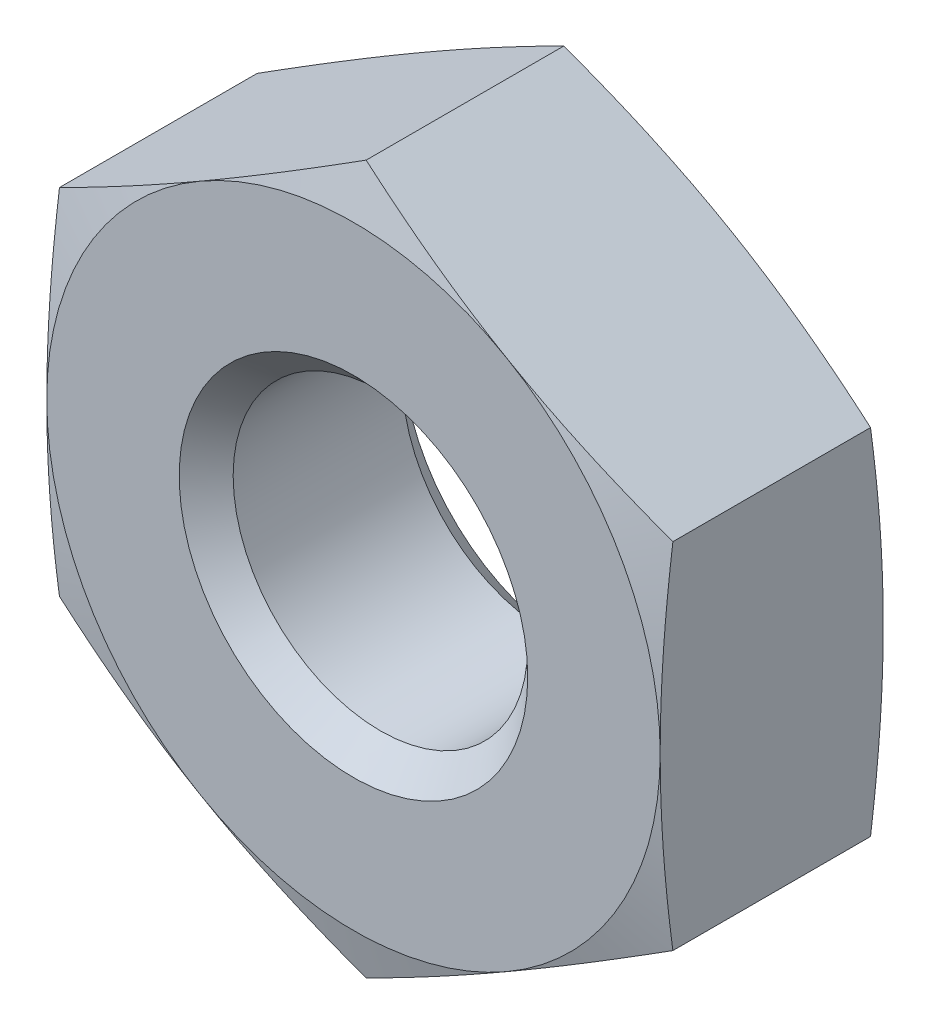
ISO-10303-21;
HEADER;
FILE_DESCRIPTION(('STEP AP214'),'2;1');
FILE_NAME('part.step','',(''),(''),'','','');
FILE_SCHEMA(('AUTOMOTIVE_DESIGN { 1 0 10303 214 1 1 1 1 }'));
ENDSEC;
DATA;
#1=APPLICATION_CONTEXT('core data for automotive mechanical design processes');
#2=APPLICATION_PROTOCOL_DEFINITION('international standard','automotive_design',2000,#1);
#3=PRODUCT_CONTEXT('',#1,'mechanical');
#4=PRODUCT('Part','Part','',(#3));
#5=PRODUCT_RELATED_PRODUCT_CATEGORY('part','',(#4));
#6=PRODUCT_DEFINITION_FORMATION('','',#4);
#7=PRODUCT_DEFINITION_CONTEXT('part definition',#1,'design');
#8=PRODUCT_DEFINITION('design','',#6,#7);
#9=PRODUCT_DEFINITION_SHAPE('','',#8);
#10=(LENGTH_UNIT() NAMED_UNIT(*) SI_UNIT(.MILLI.,.METRE.));
#11=(NAMED_UNIT(*) PLANE_ANGLE_UNIT() SI_UNIT($,.RADIAN.));
#12=(NAMED_UNIT(*) SI_UNIT($,.STERADIAN.) SOLID_ANGLE_UNIT());
#13=UNCERTAINTY_MEASURE_WITH_UNIT(LENGTH_MEASURE(1.E-05),#10,'distance_accuracy_value','');
#14=(GEOMETRIC_REPRESENTATION_CONTEXT(3) GLOBAL_UNCERTAINTY_ASSIGNED_CONTEXT((#13)) GLOBAL_UNIT_ASSIGNED_CONTEXT((#10,
#11,#12)) REPRESENTATION_CONTEXT('',''));
#15=CARTESIAN_POINT('',(0.,0.,0.));
#16=DIRECTION('',(0.,0.,1.));
#17=DIRECTION('',(1.,0.,0.));
#18=AXIS2_PLACEMENT_3D('',#15,#16,#17);
#19=CARTESIAN_POINT('',(0.,0.,0.));
#20=DIRECTION('',(0.,0.,-1.));
#21=DIRECTION('',(-1.,0.,0.));
#22=AXIS2_PLACEMENT_3D('',#19,#20,#21);
#23=PLANE('',#22);
#24=CARTESIAN_POINT('',(0.,0.,0.));
#25=DIRECTION('',(0.,0.,1.));
#26=DIRECTION('',(1.,0.,0.));
#27=AXIS2_PLACEMENT_3D('',#24,#25,#26);
#28=CIRCLE('',#27,5.588);
#29=CARTESIAN_POINT('',(5.588,0.,0.));
#30=VERTEX_POINT('',#29);
#31=CARTESIAN_POINT('',(2.79400000000005,4.83934995634742,0.));
#32=VERTEX_POINT('',#31);
#33=EDGE_CURVE('E11',#30,#32,#28,.T.);
#34=ORIENTED_EDGE('',*,*,#33,.T.);
#35=CARTESIAN_POINT('',(-2.79400000000005,4.83934995634742,0.));
#36=VERTEX_POINT('',#35);
#37=EDGE_CURVE('E44',#32,#36,#28,.T.);
#38=ORIENTED_EDGE('',*,*,#37,.T.);
#39=CARTESIAN_POINT('',(-5.588,0.,0.));
#40=VERTEX_POINT('',#39);
#41=EDGE_CURVE('E329',#36,#40,#28,.T.);
#42=ORIENTED_EDGE('',*,*,#41,.T.);
#43=CARTESIAN_POINT('',(-2.79400000000005,-4.83934995634742,0.));
#44=VERTEX_POINT('',#43);
#45=EDGE_CURVE('E322',#40,#44,#28,.T.);
#46=ORIENTED_EDGE('',*,*,#45,.T.);
#47=CARTESIAN_POINT('',(2.79400000000005,-4.83934995634742,0.));
#48=VERTEX_POINT('',#47);
#49=EDGE_CURVE('E325',#44,#48,#28,.T.);
#50=ORIENTED_EDGE('',*,*,#49,.T.);
#51=EDGE_CURVE('E45',#48,#30,#28,.T.);
#52=ORIENTED_EDGE('',*,*,#51,.T.);
#53=EDGE_LOOP('',(#34,#38,#42,#46,#50,#52));
#54=FACE_BOUND('',#53,.T.);
#55=CARTESIAN_POINT('',(0.,0.,0.));
#56=DIRECTION('',(0.,0.,1.));
#57=DIRECTION('',(1.,0.,0.));
#58=AXIS2_PLACEMENT_3D('',#55,#56,#57);
#59=CIRCLE('',#58,3.175);
#60=CARTESIAN_POINT('',(3.175,0.,0.));
#61=VERTEX_POINT('',#60);
#62=EDGE_CURVE('E186',#61,#61,#59,.T.);
#63=ORIENTED_EDGE('',*,*,#62,.F.);
#64=EDGE_LOOP('',(#63));
#65=FACE_BOUND('',#64,.T.);
#66=ADVANCED_FACE('F37',(#54,#65),#23,.F.);
#67=CARTESIAN_POINT('',(0.,5.588,-4.064));
#68=DIRECTION('',(0.,0.,1.));
#69=DIRECTION('',(1.,0.,0.));
#70=AXIS2_PLACEMENT_3D('',#67,#68,#69);
#71=PLANE('',#70);
#72=CARTESIAN_POINT('',(0.,0.,-4.064));
#73=DIRECTION('',(0.,0.,1.));
#74=DIRECTION('',(1.,0.,0.));
#75=AXIS2_PLACEMENT_3D('',#72,#73,#74);
#76=CIRCLE('',#75,5.588);
#77=CARTESIAN_POINT('',(5.588,0.,-4.064));
#78=VERTEX_POINT('',#77);
#79=CARTESIAN_POINT('',(2.79400000000005,4.83934995634742,-4.064));
#80=VERTEX_POINT('',#79);
#81=EDGE_CURVE('E360',#78,#80,#76,.T.);
#82=ORIENTED_EDGE('',*,*,#81,.F.);
#83=CARTESIAN_POINT('',(2.79400000000005,-4.83934995634742,-4.064));
#84=VERTEX_POINT('',#83);
#85=EDGE_CURVE('E363',#84,#78,#76,.T.);
#86=ORIENTED_EDGE('',*,*,#85,.F.);
#87=CARTESIAN_POINT('',(-2.79400000000005,-4.83934995634742,-4.064));
#88=VERTEX_POINT('',#87);
#89=EDGE_CURVE('E364',#88,#84,#76,.T.);
#90=ORIENTED_EDGE('',*,*,#89,.F.);
#91=CARTESIAN_POINT('',(-5.588,0.,-4.064));
#92=VERTEX_POINT('',#91);
#93=EDGE_CURVE('E144',#92,#88,#76,.T.);
#94=ORIENTED_EDGE('',*,*,#93,.F.);
#95=CARTESIAN_POINT('',(-2.79400000000005,4.83934995634742,-4.064));
#96=VERTEX_POINT('',#95);
#97=EDGE_CURVE('E361',#96,#92,#76,.T.);
#98=ORIENTED_EDGE('',*,*,#97,.F.);
#99=EDGE_CURVE('E357',#80,#96,#76,.T.);
#100=ORIENTED_EDGE('',*,*,#99,.F.);
#101=EDGE_LOOP('',(#82,#86,#90,#94,#98,#100));
#102=FACE_BOUND('',#101,.T.);
#103=CARTESIAN_POINT('',(0.,0.,-4.064));
#104=DIRECTION('',(0.,0.,1.));
#105=DIRECTION('',(1.,0.,0.));
#106=AXIS2_PLACEMENT_3D('',#103,#104,#105);
#107=CIRCLE('',#106,3.175);
#108=CARTESIAN_POINT('',(3.175,0.,-4.064));
#109=VERTEX_POINT('',#108);
#110=EDGE_CURVE('E206',#109,#109,#107,.T.);
#111=ORIENTED_EDGE('',*,*,#110,.T.);
#112=EDGE_LOOP('',(#111));
#113=FACE_BOUND('',#112,.T.);
#114=ADVANCED_FACE('F210',(#102,#113),#71,.F.);
#115=CARTESIAN_POINT('',(0.,0.,-0.29946001746102));
#116=DIRECTION('',(0.,0.,-1.));
#117=DIRECTION('',(-1.,0.,0.));
#118=AXIS2_PLACEMENT_3D('',#115,#116,#117);
#119=CONICAL_SURFACE('',#118,6.7056,1.30899693899575);
#120=CARTESIAN_POINT('',(-5.5882,3.22611783417776,-0.231664070559589));
#121=CARTESIAN_POINT('',(-5.35612782990446,3.36010476405385,-0.195746870929783));
#122=CARTESIAN_POINT('',(-5.12363487986488,3.49433463134389,-0.163139951670658));
#123=CARTESIAN_POINT('',(-4.65782789403413,3.76326842000369,-0.105852616921359));
#124=CARTESIAN_POINT('',(-4.42451356350618,3.8979725115398,-0.0811754211835394));
#125=CARTESIAN_POINT('',(-3.95847843653514,4.16703801754836,-0.0411882021790151));
#126=CARTESIAN_POINT('',(-3.72576079157954,4.30139761250865,-0.0258304913572314));
#127=CARTESIAN_POINT('',(-3.26002872031104,4.57028814922577,-0.0052373695311401));
#128=CARTESIAN_POINT('',(-3.02701436015552,4.70481905278661,0.));
#129=CARTESIAN_POINT('',(-2.56098563984448,4.97388085990829,0.));
#130=CARTESIAN_POINT('',(-2.32797127968896,5.10841176346913,-0.00523736953114312));
#131=CARTESIAN_POINT('',(-1.86223920842046,5.37730230018625,-0.0258304913572373));
#132=CARTESIAN_POINT('',(-1.62952156346486,5.51166189514654,-0.0411882021790223));
#133=CARTESIAN_POINT('',(-1.16348643649382,5.7807274011551,-0.0811754211835491));
#134=CARTESIAN_POINT('',(-0.930172105965868,5.91543149269121,-0.105852616921369));
#135=CARTESIAN_POINT('',(-0.464365120135121,6.18436528135101,-0.163139951670671));
#136=CARTESIAN_POINT('',(-0.231872170095539,6.31859514864105,-0.195746870929797));
#137=CARTESIAN_POINT('',(0.00020000000000052,6.45258207851714,-0.231664070559604));
#138=B_SPLINE_CURVE_WITH_KNOTS('',3,(#120,#121,#122,#123,#124,#125,#126,#127,#128,#129,#130,
#131,#132,#133,#134,#135,#136,#137),.UNSPECIFIED.,.F.,.F.,(4,2,2,2,2,2,2,2,4),(0.,
0.811153043466145,1.62263502922855,2.42992887829337,3.23706648113787,4.04420408398236,
4.85149793304719,5.66297991880959,6.47413296227574),.UNSPECIFIED.);
#139=CARTESIAN_POINT('',(-5.588,3.2262333042316,-0.231633129621396));
#140=VERTEX_POINT('',#139);
#141=EDGE_CURVE('E337',#140,#36,#138,.T.);
#142=ORIENTED_EDGE('',*,*,#141,.F.);
#143=CARTESIAN_POINT('',(-5.588,-8.5345781558909,-1.23610698190292));
#144=CARTESIAN_POINT('',(-5.588,-8.2810666555153,-1.17929190345188));
#145=CARTESIAN_POINT('',(-5.588,-8.02739659166418,-1.12317167601285));
#146=CARTESIAN_POINT('',(-5.588,-7.51966146428766,-1.01269598670537));
#147=CARTESIAN_POINT('',(-5.588,-7.26559638419787,-0.958340601055299));
#148=CARTESIAN_POINT('',(-5.588,-6.75676576190763,-0.851722356973886));
#149=CARTESIAN_POINT('',(-5.588,-6.50199977706657,-0.799461603507953));
#150=CARTESIAN_POINT('',(-5.588,-5.99193753642248,-0.697596721983616));
#151=CARTESIAN_POINT('',(-5.588,-5.73664128511371,-0.647992571503833));
#152=CARTESIAN_POINT('',(-5.588,-5.2274623256548,-0.552455801915283));
#153=CARTESIAN_POINT('',(-5.588,-4.97358453389165,-0.506497108885283));
#154=CARTESIAN_POINT('',(-5.588,-4.46513644926147,-0.41859214361228));
#155=CARTESIAN_POINT('',(-5.588,-4.21056617175893,-0.376645783080679));
#156=CARTESIAN_POINT('',(-5.588,-3.70068369727896,-0.297709945270376));
#157=CARTESIAN_POINT('',(-5.588,-3.44537159559778,-0.260719857769151));
#158=CARTESIAN_POINT('',(-5.588,-2.93393493875483,-0.192786603359327));
#159=CARTESIAN_POINT('',(-5.588,-2.67781038283214,-0.161843442115828));
#160=CARTESIAN_POINT('',(-5.588,-2.16185925688461,-0.106880239566573));
#161=CARTESIAN_POINT('',(-5.588,-1.90202373231597,-0.0829430089921265));
#162=CARTESIAN_POINT('',(-5.588,-1.38169945268913,-0.0436429914353551));
#163=CARTESIAN_POINT('',(-5.588,-1.12121071274943,-0.0282800078110872));
#164=CARTESIAN_POINT('',(-5.588,-0.599957865229125,-0.00702451532729913));
#165=CARTESIAN_POINT('',(-5.588,-0.339193936752168,-0.0011277027289359));
#166=CARTESIAN_POINT('',(-5.588,0.1823714205785,0.00083289998433114));
#167=CARTESIAN_POINT('',(-5.588,0.443172849399691,-0.00310330142432177));
#168=CARTESIAN_POINT('',(-5.588,0.965395783501898,-0.0205873684441134));
#169=CARTESIAN_POINT('',(-5.588,1.22681609697997,-0.0341701185888975));
#170=CARTESIAN_POINT('',(-5.588,1.74904192430596,-0.0701719589647683));
#171=CARTESIAN_POINT('',(-5.588,2.00984742441393,-0.0925912448277076));
#172=CARTESIAN_POINT('',(-5.588,2.53084143141298,-0.145133688666206));
#173=CARTESIAN_POINT('',(-5.588,2.79102942338414,-0.175261874228818));
#174=CARTESIAN_POINT('',(-5.588,3.31056805499895,-0.241968464922291));
#175=CARTESIAN_POINT('',(-5.588,3.56991869201101,-0.278546890304492));
#176=CARTESIAN_POINT('',(-5.588,4.07066345789838,-0.354386980825567));
#177=CARTESIAN_POINT('',(-5.588,4.31210931806812,-0.393310528582692));
#178=CARTESIAN_POINT('',(-5.588,4.79436465416929,-0.474935820185719));
#179=CARTESIAN_POINT('',(-5.588,5.03517411255358,-0.517637667111996));
#180=CARTESIAN_POINT('',(-5.588,5.51624475472888,-0.606128311310801));
#181=CARTESIAN_POINT('',(-5.588,5.75650588738696,-0.65191738521801));
#182=CARTESIAN_POINT('',(-5.588,6.23653469126863,-0.746018904252824));
#183=CARTESIAN_POINT('',(-5.588,6.4763023560569,-0.794331382074125));
#184=CARTESIAN_POINT('',(-5.588,7.19507734129352,-0.942368376905111));
#185=CARTESIAN_POINT('',(-5.588,7.67344976698298,-1.04517234354635));
#186=CARTESIAN_POINT('',(-5.588,8.6289224376089,-1.25634555799704));
#187=CARTESIAN_POINT('',(-5.588,9.10602275524918,-1.36471448026011));
#188=CARTESIAN_POINT('',(-5.588,10.0546296591299,-1.58428870830944));
#189=CARTESIAN_POINT('',(-5.588,10.5261451434712,-1.69545567846192));
#190=CARTESIAN_POINT('',(-5.588,11.468518305583,-1.9205727346029));
#191=CARTESIAN_POINT('',(-5.588,11.9393759712045,-2.03452287129334));
#192=CARTESIAN_POINT('',(-5.588,12.8800071547142,-2.26433759268933));
#193=CARTESIAN_POINT('',(-5.588,13.3497812934371,-2.38019964138322));
#194=CARTESIAN_POINT('',(-5.588,14.2889203682476,-2.61350580925147));
#195=CARTESIAN_POINT('',(-5.588,14.7582853173276,-2.73094987608966));
#196=CARTESIAN_POINT('',(-5.588,15.2275076501709,-2.84895420254379));
#197=B_SPLINE_CURVE_WITH_KNOTS('',3,(#143,#144,#145,#146,#147,#148,#149,#150,#151,#152,#153,
#154,#155,#156,#157,#158,#159,#160,#161,#162,#163,#164,#165,#166,#167,#168,#169,#170,#171,#172,
#173,#174,#175,#176,#177,#178,#179,#180,#181,#182,#183,#184,#185,#186,#187,#188,#189,#190,#191,
#192,#193,#194,#195,#196),.UNSPECIFIED.,.F.,.F.,(4,2,2,2,2,2,2,2,2,2,2,2,2,2,2,2,2,2,2,2,2,2,2,
2,2,2,4),(0.,0.77940313721841,1.55883988993779,2.33904122995756,3.1192359841433,
3.89322268107899,4.66719234305344,5.4410666251817,6.21494163231528,6.99762519889382,
7.78029081465488,8.5626004952282,9.34490950142015,10.1300620493507,10.9152319807312,
11.7009152949557,12.4866010759757,13.2202552360327,13.9539294179764,14.6876694292733,
15.4214189494036,16.8892442231801,18.3569837277075,19.8103005500229,21.2636438677041,
22.7151937170009,24.1666956636387),.UNSPECIFIED.);
#198=EDGE_CURVE('E155',#40,#140,#197,.T.);
#199=ORIENTED_EDGE('',*,*,#198,.F.);
#200=ORIENTED_EDGE('',*,*,#41,.F.);
#201=EDGE_LOOP('',(#142,#199,#200));
#202=FACE_BOUND('',#201,.T.);
#203=ADVANCED_FACE('F228',(#202),#119,.T.);
#204=CARTESIAN_POINT('',(0.,6.4524666084633,-0.23163312962141));
#205=VERTEX_POINT('',#204);
#206=EDGE_CURVE('E334',#36,#205,#138,.T.);
#207=ORIENTED_EDGE('',*,*,#206,.F.);
#208=ORIENTED_EDGE('',*,*,#37,.F.);
#209=CARTESIAN_POINT('',(-0.0002,6.45258207851714,-0.231664070559604));
#210=CARTESIAN_POINT('',(0.231872170095539,6.31859514864105,-0.195746870929797));
#211=CARTESIAN_POINT('',(0.464365120135121,6.18436528135101,-0.163139951670671));
#212=CARTESIAN_POINT('',(0.930172105965868,5.91543149269121,-0.105852616921369));
#213=CARTESIAN_POINT('',(1.16348643649382,5.7807274011551,-0.081175421183549));
#214=CARTESIAN_POINT('',(1.62952156346486,5.51166189514654,-0.0411882021790222));
#215=CARTESIAN_POINT('',(1.86223920842046,5.37730230018625,-0.0258304913572372));
#216=CARTESIAN_POINT('',(2.32797127968896,5.10841176346913,-0.00523736953114299));
#217=CARTESIAN_POINT('',(2.56098563984448,4.97388085990829,0.));
#218=CARTESIAN_POINT('',(3.02701436015552,4.70481905278661,0.));
#219=CARTESIAN_POINT('',(3.26002872031104,4.57028814922577,-0.00523736953114009));
#220=CARTESIAN_POINT('',(3.72576079157954,4.30139761250865,-0.0258304913572314));
#221=CARTESIAN_POINT('',(3.95847843653514,4.16703801754836,-0.041188202179015));
#222=CARTESIAN_POINT('',(4.42451356350618,3.8979725115398,-0.0811754211835393));
#223=CARTESIAN_POINT('',(4.65782789403413,3.76326842000369,-0.105852616921359));
#224=CARTESIAN_POINT('',(5.12363487986488,3.49433463134389,-0.163139951670658));
#225=CARTESIAN_POINT('',(5.35612782990446,3.36010476405385,-0.195746870929783));
#226=CARTESIAN_POINT('',(5.5882,3.22611783417776,-0.231664070559589));
#227=B_SPLINE_CURVE_WITH_KNOTS('',3,(#209,#210,#211,#212,#213,#214,#215,#216,#217,#218,#219,
#220,#221,#222,#223,#224,#225,#226),.UNSPECIFIED.,.F.,.F.,(4,2,2,2,2,2,2,2,4),(0.,
0.811153043466144,1.62263502922855,2.42992887829337,3.23706648113787,4.04420408398236,
4.85149793304719,5.66297991880959,6.47413296227574),.UNSPECIFIED.);
#228=EDGE_CURVE('E267',#205,#32,#227,.T.);
#229=ORIENTED_EDGE('',*,*,#228,.F.);
#230=EDGE_LOOP('',(#207,#208,#229));
#231=FACE_BOUND('',#230,.T.);
#232=ADVANCED_FACE('F276',(#231),#119,.T.);
#233=CARTESIAN_POINT('',(5.588,3.2262333042316,-0.231633129621396));
#234=VERTEX_POINT('',#233);
#235=EDGE_CURVE('E262',#32,#234,#227,.T.);
#236=ORIENTED_EDGE('',*,*,#235,.F.);
#237=ORIENTED_EDGE('',*,*,#33,.F.);
#238=CARTESIAN_POINT('',(5.588,-8.5345781558909,-1.23610698190292));
#239=CARTESIAN_POINT('',(5.588,-8.2810666555153,-1.17929190345188));
#240=CARTESIAN_POINT('',(5.588,-8.02739659166418,-1.12317167601285));
#241=CARTESIAN_POINT('',(5.588,-7.51966146428766,-1.01269598670537));
#242=CARTESIAN_POINT('',(5.588,-7.26559638419787,-0.958340601055299));
#243=CARTESIAN_POINT('',(5.588,-6.75676576190763,-0.851722356973886));
#244=CARTESIAN_POINT('',(5.588,-6.50199977706657,-0.799461603507953));
#245=CARTESIAN_POINT('',(5.588,-5.99193753642248,-0.697596721983616));
#246=CARTESIAN_POINT('',(5.588,-5.73664128511371,-0.647992571503833));
#247=CARTESIAN_POINT('',(5.588,-5.2274623256548,-0.552455801915283));
#248=CARTESIAN_POINT('',(5.588,-4.97358453389165,-0.506497108885283));
#249=CARTESIAN_POINT('',(5.588,-4.46513644926147,-0.41859214361228));
#250=CARTESIAN_POINT('',(5.588,-4.21056617175893,-0.376645783080679));
#251=CARTESIAN_POINT('',(5.588,-3.70068369727896,-0.297709945270376));
#252=CARTESIAN_POINT('',(5.588,-3.44537159559778,-0.260719857769151));
#253=CARTESIAN_POINT('',(5.588,-2.93393493875483,-0.192786603359327));
#254=CARTESIAN_POINT('',(5.588,-2.67781038283214,-0.161843442115828));
#255=CARTESIAN_POINT('',(5.588,-2.16185925688461,-0.106880239566573));
#256=CARTESIAN_POINT('',(5.588,-1.90202373231597,-0.0829430089921265));
#257=CARTESIAN_POINT('',(5.588,-1.38169945268913,-0.0436429914353551));
#258=CARTESIAN_POINT('',(5.588,-1.12121071274943,-0.0282800078110872));
#259=CARTESIAN_POINT('',(5.588,-0.599957865229125,-0.00702451532729913));
#260=CARTESIAN_POINT('',(5.588,-0.339193936752168,-0.0011277027289359));
#261=CARTESIAN_POINT('',(5.588,0.1823714205785,0.00083289998433114));
#262=CARTESIAN_POINT('',(5.588,0.443172849399691,-0.00310330142432177));
#263=CARTESIAN_POINT('',(5.588,0.965395783501898,-0.0205873684441134));
#264=CARTESIAN_POINT('',(5.588,1.22681609697997,-0.0341701185888975));
#265=CARTESIAN_POINT('',(5.588,1.74904192430596,-0.0701719589647683));
#266=CARTESIAN_POINT('',(5.588,2.00984742441393,-0.0925912448277076));
#267=CARTESIAN_POINT('',(5.588,2.53084143141298,-0.145133688666206));
#268=CARTESIAN_POINT('',(5.588,2.79102942338414,-0.175261874228818));
#269=CARTESIAN_POINT('',(5.588,3.31056805499895,-0.241968464922291));
#270=CARTESIAN_POINT('',(5.588,3.56991869201101,-0.278546890304492));
#271=CARTESIAN_POINT('',(5.588,4.07066345789838,-0.354386980825567));
#272=CARTESIAN_POINT('',(5.588,4.31210931806812,-0.393310528582692));
#273=CARTESIAN_POINT('',(5.588,4.79436465416929,-0.474935820185719));
#274=CARTESIAN_POINT('',(5.588,5.03517411255358,-0.517637667111996));
#275=CARTESIAN_POINT('',(5.588,5.51624475472888,-0.606128311310801));
#276=CARTESIAN_POINT('',(5.588,5.75650588738696,-0.65191738521801));
#277=CARTESIAN_POINT('',(5.588,6.23653469126863,-0.746018904252824));
#278=CARTESIAN_POINT('',(5.588,6.4763023560569,-0.794331382074125));
#279=CARTESIAN_POINT('',(5.588,7.19507734129352,-0.942368376905111));
#280=CARTESIAN_POINT('',(5.588,7.67344976698298,-1.04517234354635));
#281=CARTESIAN_POINT('',(5.588,8.6289224376089,-1.25634555799704));
#282=CARTESIAN_POINT('',(5.588,9.10602275524918,-1.36471448026011));
#283=CARTESIAN_POINT('',(5.588,10.0546296591299,-1.58428870830944));
#284=CARTESIAN_POINT('',(5.588,10.5261451434712,-1.69545567846192));
#285=CARTESIAN_POINT('',(5.588,11.468518305583,-1.9205727346029));
#286=CARTESIAN_POINT('',(5.588,11.9393759712045,-2.03452287129334));
#287=CARTESIAN_POINT('',(5.588,12.8800071547142,-2.26433759268933));
#288=CARTESIAN_POINT('',(5.588,13.3497812934371,-2.38019964138322));
#289=CARTESIAN_POINT('',(5.588,14.2889203682476,-2.61350580925147));
#290=CARTESIAN_POINT('',(5.588,14.7582853173276,-2.73094987608966));
#291=CARTESIAN_POINT('',(5.588,15.2275076501709,-2.84895420254379));
#292=B_SPLINE_CURVE_WITH_KNOTS('',3,(#238,#239,#240,#241,#242,#243,#244,#245,#246,#247,#248,
#249,#250,#251,#252,#253,#254,#255,#256,#257,#258,#259,#260,#261,#262,#263,#264,#265,#266,#267,
#268,#269,#270,#271,#272,#273,#274,#275,#276,#277,#278,#279,#280,#281,#282,#283,#284,#285,#286,
#287,#288,#289,#290,#291),.UNSPECIFIED.,.F.,.F.,(4,2,2,2,2,2,2,2,2,2,2,2,2,2,2,2,2,2,2,2,2,2,2,
2,2,2,4),(0.,0.77940313721841,1.55883988993779,2.33904122995756,3.1192359841433,
3.89322268107899,4.66719234305344,5.4410666251817,6.21494163231528,6.99762519889382,
7.78029081465488,8.5626004952282,9.34490950142015,10.1300620493507,10.9152319807312,
11.7009152949557,12.4866010759757,13.2202552360327,13.9539294179764,14.6876694292733,
15.4214189494036,16.8892442231801,18.3569837277075,19.8103005500229,21.2636438677041,
22.7151937170009,24.1666956636387),.UNSPECIFIED.);
#293=EDGE_CURVE('E294',#234,#30,#292,.F.);
#294=ORIENTED_EDGE('',*,*,#293,.F.);
#295=EDGE_LOOP('',(#236,#237,#294));
#296=FACE_BOUND('',#295,.T.);
#297=ADVANCED_FACE('F348',(#296),#119,.T.);
#298=CARTESIAN_POINT('',(5.588,-3.2262333042316,-0.231633129621396));
#299=VERTEX_POINT('',#298);
#300=EDGE_CURVE('E290',#30,#299,#292,.F.);
#301=ORIENTED_EDGE('',*,*,#300,.F.);
#302=ORIENTED_EDGE('',*,*,#51,.F.);
#303=CARTESIAN_POINT('',(5.5882,-3.22611783417776,-0.231664070559589));
#304=CARTESIAN_POINT('',(5.35612782990446,-3.36010476405385,-0.195746870929783));
#305=CARTESIAN_POINT('',(5.12363487986488,-3.49433463134389,-0.163139951670658));
#306=CARTESIAN_POINT('',(4.65782789403413,-3.76326842000369,-0.105852616921359));
#307=CARTESIAN_POINT('',(4.42451356350618,-3.8979725115398,-0.0811754211835394));
#308=CARTESIAN_POINT('',(3.95847843653514,-4.16703801754836,-0.0411882021790151));
#309=CARTESIAN_POINT('',(3.72576079157954,-4.30139761250865,-0.0258304913572314));
#310=CARTESIAN_POINT('',(3.26002872031104,-4.57028814922577,-0.0052373695311401));
#311=CARTESIAN_POINT('',(3.02701436015552,-4.70481905278661,0.));
#312=CARTESIAN_POINT('',(2.56098563984448,-4.97388085990829,0.));
#313=CARTESIAN_POINT('',(2.32797127968896,-5.10841176346913,-0.00523736953114312));
#314=CARTESIAN_POINT('',(1.86223920842046,-5.37730230018625,-0.0258304913572373));
#315=CARTESIAN_POINT('',(1.62952156346486,-5.51166189514654,-0.0411882021790223));
#316=CARTESIAN_POINT('',(1.16348643649382,-5.7807274011551,-0.0811754211835491));
#317=CARTESIAN_POINT('',(0.930172105965868,-5.91543149269121,-0.105852616921369));
#318=CARTESIAN_POINT('',(0.464365120135121,-6.18436528135101,-0.163139951670671));
#319=CARTESIAN_POINT('',(0.231872170095539,-6.31859514864105,-0.195746870929797));
#320=CARTESIAN_POINT('',(-0.00020000000000052,-6.45258207851714,-0.231664070559604));
#321=B_SPLINE_CURVE_WITH_KNOTS('',3,(#303,#304,#305,#306,#307,#308,#309,#310,#311,#312,#313,
#314,#315,#316,#317,#318,#319,#320),.UNSPECIFIED.,.F.,.F.,(4,2,2,2,2,2,2,2,4),(0.,
0.811153043466145,1.62263502922855,2.42992887829337,3.23706648113787,4.04420408398236,
4.85149793304719,5.66297991880959,6.47413296227574),.UNSPECIFIED.);
#322=EDGE_CURVE('E300',#299,#48,#321,.T.);
#323=ORIENTED_EDGE('',*,*,#322,.F.);
#324=EDGE_LOOP('',(#301,#302,#323));
#325=FACE_BOUND('',#324,.T.);
#326=ADVANCED_FACE('F388',(#325),#119,.T.);
#327=CARTESIAN_POINT('',(0.,-6.4524666084633,-0.23163312962141));
#328=VERTEX_POINT('',#327);
#329=EDGE_CURVE('E285',#48,#328,#321,.T.);
#330=ORIENTED_EDGE('',*,*,#329,.F.);
#331=ORIENTED_EDGE('',*,*,#49,.F.);
#332=CARTESIAN_POINT('',(0.0002,-6.45258207851714,-0.231664070559604));
#333=CARTESIAN_POINT('',(-0.231872170095539,-6.31859514864105,-0.195746870929797));
#334=CARTESIAN_POINT('',(-0.464365120135121,-6.18436528135101,-0.163139951670671));
#335=CARTESIAN_POINT('',(-0.930172105965868,-5.91543149269121,-0.105852616921369));
#336=CARTESIAN_POINT('',(-1.16348643649382,-5.7807274011551,-0.081175421183549));
#337=CARTESIAN_POINT('',(-1.62952156346486,-5.51166189514654,-0.0411882021790222));
#338=CARTESIAN_POINT('',(-1.86223920842046,-5.37730230018625,-0.0258304913572372));
#339=CARTESIAN_POINT('',(-2.32797127968896,-5.10841176346913,-0.00523736953114299));
#340=CARTESIAN_POINT('',(-2.56098563984448,-4.97388085990829,0.));
#341=CARTESIAN_POINT('',(-3.02701436015552,-4.70481905278661,0.));
#342=CARTESIAN_POINT('',(-3.26002872031104,-4.57028814922577,-0.00523736953114009));
#343=CARTESIAN_POINT('',(-3.72576079157954,-4.30139761250865,-0.0258304913572314));
#344=CARTESIAN_POINT('',(-3.95847843653514,-4.16703801754836,-0.041188202179015));
#345=CARTESIAN_POINT('',(-4.42451356350618,-3.8979725115398,-0.0811754211835393));
#346=CARTESIAN_POINT('',(-4.65782789403413,-3.76326842000369,-0.105852616921359));
#347=CARTESIAN_POINT('',(-5.12363487986488,-3.49433463134389,-0.163139951670658));
#348=CARTESIAN_POINT('',(-5.35612782990446,-3.36010476405385,-0.195746870929783));
#349=CARTESIAN_POINT('',(-5.5882,-3.22611783417776,-0.231664070559589));
#350=B_SPLINE_CURVE_WITH_KNOTS('',3,(#332,#333,#334,#335,#336,#337,#338,#339,#340,#341,#342,
#343,#344,#345,#346,#347,#348,#349),.UNSPECIFIED.,.F.,.F.,(4,2,2,2,2,2,2,2,4),(0.,
0.811153043466144,1.62263502922855,2.42992887829337,3.23706648113787,4.04420408398236,
4.85149793304719,5.66297991880959,6.47413296227574),.UNSPECIFIED.);
#351=EDGE_CURVE('E147',#328,#44,#350,.T.);
#352=ORIENTED_EDGE('',*,*,#351,.F.);
#353=EDGE_LOOP('',(#330,#331,#352));
#354=FACE_BOUND('',#353,.T.);
#355=ADVANCED_FACE('F326',(#354),#119,.T.);
#356=CARTESIAN_POINT('',(-5.588,-3.2262333042316,-0.231633129621396));
#357=VERTEX_POINT('',#356);
#358=EDGE_CURVE('E139',#44,#357,#350,.T.);
#359=ORIENTED_EDGE('',*,*,#358,.F.);
#360=ORIENTED_EDGE('',*,*,#45,.F.);
#361=EDGE_CURVE('E52',#357,#40,#197,.T.);
#362=ORIENTED_EDGE('',*,*,#361,.F.);
#363=EDGE_LOOP('',(#359,#360,#362));
#364=FACE_BOUND('',#363,.T.);
#365=ADVANCED_FACE('F278',(#364),#119,.T.);
#366=CARTESIAN_POINT('',(0.,6.4524666084633,-4.064));
#367=DIRECTION('',(-0.500000000000008,0.866025403784434,0.));
#368=DIRECTION('',(-0.866025403784434,-0.500000000000008,0.));
#369=AXIS2_PLACEMENT_3D('',#366,#367,#368);
#370=PLANE('',#369);
#371=ORIENTED_EDGE('',*,*,#141,.T.);
#372=ORIENTED_EDGE('',*,*,#206,.T.);
#373=DIRECTION('',(0.,0.,1.));
#374=VECTOR('',#373,1.);
#375=CARTESIAN_POINT('',(0.,6.4524666084633,-4.064));
#376=LINE('',#375,#374);
#377=CARTESIAN_POINT('',(0.,6.4524666084633,-3.83236687037861));
#378=VERTEX_POINT('',#377);
#379=EDGE_CURVE('E132',#378,#205,#376,.T.);
#380=ORIENTED_EDGE('',*,*,#379,.F.);
#381=CARTESIAN_POINT('',(0.00020000000000005,6.45258207851714,-3.83233592944041));
#382=CARTESIAN_POINT('',(-0.23187217009554,6.31859514864105,-3.86825312907022));
#383=CARTESIAN_POINT('',(-0.464365120135121,6.18436528135101,-3.90086004832934));
#384=CARTESIAN_POINT('',(-0.930172105965868,5.91543149269121,-3.95814738307864));
#385=CARTESIAN_POINT('',(-1.16348643649382,5.7807274011551,-3.98282457881646));
#386=CARTESIAN_POINT('',(-1.62952156346486,5.51166189514654,-4.02281179782098));
#387=CARTESIAN_POINT('',(-1.86223920842046,5.37730230018625,-4.03816950864277));
#388=CARTESIAN_POINT('',(-2.32797127968896,5.10841176346913,-4.05876263046886));
#389=CARTESIAN_POINT('',(-2.56098563984448,4.97388085990829,-4.064));
#390=CARTESIAN_POINT('',(-3.02701436015552,4.70481905278661,-4.064));
#391=CARTESIAN_POINT('',(-3.26002872031104,4.57028814922577,-4.05876263046886));
#392=CARTESIAN_POINT('',(-3.72576079157954,4.30139761250865,-4.03816950864277));
#393=CARTESIAN_POINT('',(-3.95847843653514,4.16703801754836,-4.02281179782099));
#394=CARTESIAN_POINT('',(-4.42451356350618,3.8979725115398,-3.98282457881647));
#395=CARTESIAN_POINT('',(-4.65782789403413,3.76326842000369,-3.95814738307865));
#396=CARTESIAN_POINT('',(-5.12363487986488,3.49433463134389,-3.90086004832935));
#397=CARTESIAN_POINT('',(-5.35612782990446,3.36010476405385,-3.86825312907023));
#398=CARTESIAN_POINT('',(-5.5882,3.22611783417776,-3.83233592944043));
#399=B_SPLINE_CURVE_WITH_KNOTS('',3,(#381,#382,#383,#384,#385,#386,#387,#388,#389,#390,#391,
#392,#393,#394,#395,#396,#397,#398),.UNSPECIFIED.,.F.,.F.,(4,2,2,2,2,2,2,2,4),(0.,
0.811153043466144,1.62263502922855,2.42992887829337,3.23706648113787,4.04420408398236,
4.85149793304719,5.66297991880959,6.47413296227573),.UNSPECIFIED.);
#400=EDGE_CURVE('E338',#378,#96,#399,.T.);
#401=ORIENTED_EDGE('',*,*,#400,.T.);
#402=CARTESIAN_POINT('',(-5.588,3.2262333042316,-3.83236687037862));
#403=VERTEX_POINT('',#402);
#404=EDGE_CURVE('E269',#96,#403,#399,.T.);
#405=ORIENTED_EDGE('',*,*,#404,.T.);
#406=DIRECTION('',(0.,0.,1.));
#407=VECTOR('',#406,1.);
#408=CARTESIAN_POINT('',(-5.588,3.2262333042316,-4.064));
#409=LINE('',#408,#407);
#410=EDGE_CURVE('E141',#403,#140,#409,.T.);
#411=ORIENTED_EDGE('',*,*,#410,.T.);
#412=EDGE_LOOP('',(#371,#372,#380,#401,#405,#411));
#413=FACE_BOUND('',#412,.T.);
#414=ADVANCED_FACE('F178',(#413),#370,.T.);
#415=CARTESIAN_POINT('',(5.588,3.2262333042316,-4.064));
#416=DIRECTION('',(0.500000000000008,0.866025403784434,0.));
#417=DIRECTION('',(-0.866025403784434,0.500000000000008,0.));
#418=AXIS2_PLACEMENT_3D('',#415,#416,#417);
#419=PLANE('',#418);
#420=ORIENTED_EDGE('',*,*,#228,.T.);
#421=ORIENTED_EDGE('',*,*,#235,.T.);
#422=DIRECTION('',(0.,0.,1.));
#423=VECTOR('',#422,1.);
#424=CARTESIAN_POINT('',(5.588,3.2262333042316,-4.064));
#425=LINE('',#424,#423);
#426=CARTESIAN_POINT('',(5.588,3.2262333042316,-3.83236687037862));
#427=VERTEX_POINT('',#426);
#428=EDGE_CURVE('E193',#427,#234,#425,.T.);
#429=ORIENTED_EDGE('',*,*,#428,.F.);
#430=CARTESIAN_POINT('',(5.5882,3.22611783417776,-3.83233592944043));
#431=CARTESIAN_POINT('',(5.35612782990446,3.36010476405385,-3.86825312907023));
#432=CARTESIAN_POINT('',(5.12363487986488,3.49433463134389,-3.90086004832935));
#433=CARTESIAN_POINT('',(4.65782789403413,3.76326842000369,-3.95814738307865));
#434=CARTESIAN_POINT('',(4.42451356350618,3.8979725115398,-3.98282457881647));
#435=CARTESIAN_POINT('',(3.95847843653514,4.16703801754836,-4.02281179782099));
#436=CARTESIAN_POINT('',(3.72576079157954,4.30139761250865,-4.03816950864277));
#437=CARTESIAN_POINT('',(3.26002872031104,4.57028814922577,-4.05876263046886));
#438=CARTESIAN_POINT('',(3.02701436015552,4.70481905278661,-4.064));
#439=CARTESIAN_POINT('',(2.56098563984448,4.97388085990829,-4.064));
#440=CARTESIAN_POINT('',(2.32797127968896,5.10841176346913,-4.05876263046886));
#441=CARTESIAN_POINT('',(1.86223920842046,5.37730230018625,-4.03816950864277));
#442=CARTESIAN_POINT('',(1.62952156346486,5.51166189514654,-4.02281179782098));
#443=CARTESIAN_POINT('',(1.16348643649382,5.7807274011551,-3.98282457881646));
#444=CARTESIAN_POINT('',(0.930172105965869,5.91543149269121,-3.95814738307864));
#445=CARTESIAN_POINT('',(0.464365120135122,6.18436528135101,-3.90086004832934));
#446=CARTESIAN_POINT('',(0.23187217009554,6.31859514864105,-3.86825312907022));
#447=CARTESIAN_POINT('',(-0.000199999999999917,6.45258207851714,-3.83233592944041));
#448=B_SPLINE_CURVE_WITH_KNOTS('',3,(#430,#431,#432,#433,#434,#435,#436,#437,#438,#439,#440,
#441,#442,#443,#444,#445,#446,#447),.UNSPECIFIED.,.F.,.F.,(4,2,2,2,2,2,2,2,4),(0.,
0.811153043466144,1.62263502922855,2.42992887829337,3.23706648113787,4.04420408398236,
4.85149793304719,5.66297991880959,6.47413296227573),.UNSPECIFIED.);
#449=EDGE_CURVE('E268',#427,#80,#448,.T.);
#450=ORIENTED_EDGE('',*,*,#449,.T.);
#451=EDGE_CURVE('E256',#80,#378,#448,.T.);
#452=ORIENTED_EDGE('',*,*,#451,.T.);
#453=ORIENTED_EDGE('',*,*,#379,.T.);
#454=EDGE_LOOP('',(#420,#421,#429,#450,#452,#453));
#455=FACE_BOUND('',#454,.T.);
#456=ADVANCED_FACE('F248',(#455),#419,.T.);
#457=CARTESIAN_POINT('',(5.588,-3.2262333042316,-4.064));
#458=DIRECTION('',(1.,0.,0.));
#459=DIRECTION('',(0.,0.,-1.));
#460=AXIS2_PLACEMENT_3D('',#457,#458,#459);
#461=PLANE('',#460);
#462=ORIENTED_EDGE('',*,*,#293,.T.);
#463=ORIENTED_EDGE('',*,*,#300,.T.);
#464=DIRECTION('',(0.,0.,1.));
#465=VECTOR('',#464,1.);
#466=CARTESIAN_POINT('',(5.588,-3.2262333042316,-4.064));
#467=LINE('',#466,#465);
#468=CARTESIAN_POINT('',(5.588,-3.2262333042316,-3.83236687037862));
#469=VERTEX_POINT('',#468);
#470=EDGE_CURVE('E190',#469,#299,#467,.T.);
#471=ORIENTED_EDGE('',*,*,#470,.F.);
#472=CARTESIAN_POINT('',(5.588,-8.53457815589089,-2.82789301809716));
#473=CARTESIAN_POINT('',(5.588,-8.2810666555153,-2.8847080965482));
#474=CARTESIAN_POINT('',(5.588,-8.02739659166418,-2.94082832398722));
#475=CARTESIAN_POINT('',(5.588,-7.51966146428765,-3.0513040132947));
#476=CARTESIAN_POINT('',(5.588,-7.26559638419787,-3.10565939894477));
#477=CARTESIAN_POINT('',(5.588,-6.75676576190763,-3.21227764302617));
#478=CARTESIAN_POINT('',(5.588,-6.50199977706657,-3.2645383964921));
#479=CARTESIAN_POINT('',(5.588,-5.99193753642248,-3.36640327801643));
#480=CARTESIAN_POINT('',(5.588,-5.73664128511371,-3.41600742849621));
#481=CARTESIAN_POINT('',(5.588,-5.2274623256548,-3.51154419808475));
#482=CARTESIAN_POINT('',(5.588,-4.97358453389165,-3.55750289111475));
#483=CARTESIAN_POINT('',(5.588,-4.46513644926147,-3.64540785638775));
#484=CARTESIAN_POINT('',(5.588,-4.21056617175893,-3.68735421691935));
#485=CARTESIAN_POINT('',(5.588,-3.70068369727896,-3.76629005472964));
#486=CARTESIAN_POINT('',(5.588,-3.44537159559778,-3.80328014223087));
#487=CARTESIAN_POINT('',(5.588,-2.93393493875483,-3.87121339664069));
#488=CARTESIAN_POINT('',(5.588,-2.67781038283214,-3.90215655788418));
#489=CARTESIAN_POINT('',(5.588,-2.16185925688461,-3.95711976043343));
#490=CARTESIAN_POINT('',(5.588,-1.90202373231597,-3.98105699100788));
#491=CARTESIAN_POINT('',(5.588,-1.38169945268914,-4.02035700856465));
#492=CARTESIAN_POINT('',(5.588,-1.12121071274944,-4.03571999218892));
#493=CARTESIAN_POINT('',(5.588,-0.599957865229132,-4.0569754846727));
#494=CARTESIAN_POINT('',(5.588,-0.339193936752176,-4.06287229727106));
#495=CARTESIAN_POINT('',(5.588,0.182371420578491,-4.06483289998433));
#496=CARTESIAN_POINT('',(5.588,0.443172849399681,-4.06089669857568));
#497=CARTESIAN_POINT('',(5.588,0.965395783501886,-4.04341263155589));
#498=CARTESIAN_POINT('',(5.588,1.22681609697996,-4.02982988141111));
#499=CARTESIAN_POINT('',(5.588,1.74904192430595,-3.99382804103524));
#500=CARTESIAN_POINT('',(5.588,2.00984742441392,-3.9714087551723));
#501=CARTESIAN_POINT('',(5.588,2.53084143141296,-3.9188663113338));
#502=CARTESIAN_POINT('',(5.588,2.79102942338412,-3.8887381257712));
#503=CARTESIAN_POINT('',(5.588,3.31056805499893,-3.82203153507773));
#504=CARTESIAN_POINT('',(5.588,3.56991869201099,-3.78545310969553));
#505=CARTESIAN_POINT('',(5.588,4.07066345789836,-3.70961301917446));
#506=CARTESIAN_POINT('',(5.588,4.3121093180681,-3.67068947141734));
#507=CARTESIAN_POINT('',(5.588,4.79436465416927,-3.58906417981432));
#508=CARTESIAN_POINT('',(5.588,5.03517411255355,-3.54636233288804));
#509=CARTESIAN_POINT('',(5.588,5.51624475472886,-3.45787168868924));
#510=CARTESIAN_POINT('',(5.588,5.75650588738694,-3.41208261478204));
#511=CARTESIAN_POINT('',(5.588,6.23653469126861,-3.31798109574723));
#512=CARTESIAN_POINT('',(5.588,6.47630235605689,-3.26966861792593));
#513=CARTESIAN_POINT('',(5.588,7.1950773412935,-3.12163162309496));
#514=CARTESIAN_POINT('',(5.588,7.67344976698297,-3.01882765645372));
#515=CARTESIAN_POINT('',(5.588,8.62892243760889,-2.80765444200305));
#516=CARTESIAN_POINT('',(5.588,9.10602275524917,-2.69928551973999));
#517=CARTESIAN_POINT('',(5.588,10.0546296591299,-2.47971129169067));
#518=CARTESIAN_POINT('',(5.588,10.5261451434712,-2.3685443215382));
#519=CARTESIAN_POINT('',(5.588,11.468518305583,-2.14342726539723));
#520=CARTESIAN_POINT('',(5.588,11.9393759712045,-2.0294771287068));
#521=CARTESIAN_POINT('',(5.588,12.8800071547142,-1.79966240731082));
#522=CARTESIAN_POINT('',(5.588,13.3497812934372,-1.68380035861694));
#523=CARTESIAN_POINT('',(5.588,14.2889203682476,-1.45049419074871));
#524=CARTESIAN_POINT('',(5.588,14.7582853173276,-1.33305012391053));
#525=CARTESIAN_POINT('',(5.588,15.2275076501709,-1.2150457974564));
#526=B_SPLINE_CURVE_WITH_KNOTS('',3,(#472,#473,#474,#475,#476,#477,#478,#479,#480,#481,#482,
#483,#484,#485,#486,#487,#488,#489,#490,#491,#492,#493,#494,#495,#496,#497,#498,#499,#500,#501,
#502,#503,#504,#505,#506,#507,#508,#509,#510,#511,#512,#513,#514,#515,#516,#517,#518,#519,#520,
#521,#522,#523,#524,#525),.UNSPECIFIED.,.F.,.F.,(4,2,2,2,2,2,2,2,2,2,2,2,2,2,2,2,2,2,2,2,2,2,2,
2,2,2,4),(0.,0.779403137218408,1.55883988993779,2.33904122995755,3.11923598414329,
3.89322268107897,4.66719234305342,5.44106662518169,6.21494163231526,6.9976251988938,
7.78029081465486,8.56260049522817,9.34490950142013,10.1300620493507,10.9152319807311,
11.7009152949556,12.4866010759757,13.2202552360326,13.9539294179764,14.6876694292732,
15.4214189494035,16.8892442231801,18.3569837277074,19.8103005500228,21.263643867704,
22.7151937170008,24.1666956636387),.UNSPECIFIED.);
#527=EDGE_CURVE('E295',#469,#78,#526,.T.);
#528=ORIENTED_EDGE('',*,*,#527,.T.);
#529=EDGE_CURVE('E296',#78,#427,#526,.T.);
#530=ORIENTED_EDGE('',*,*,#529,.T.);
#531=ORIENTED_EDGE('',*,*,#428,.T.);
#532=EDGE_LOOP('',(#462,#463,#471,#528,#530,#531));
#533=FACE_BOUND('',#532,.T.);
#534=ADVANCED_FACE('F251',(#533),#461,.T.);
#535=CARTESIAN_POINT('',(0.,-6.4524666084633,-4.064));
#536=DIRECTION('',(0.500000000000008,-0.866025403784434,0.));
#537=DIRECTION('',(0.866025403784434,0.500000000000008,0.));
#538=AXIS2_PLACEMENT_3D('',#535,#536,#537);
#539=PLANE('',#538);
#540=ORIENTED_EDGE('',*,*,#322,.T.);
#541=ORIENTED_EDGE('',*,*,#329,.T.);
#542=DIRECTION('',(0.,0.,1.));
#543=VECTOR('',#542,1.);
#544=CARTESIAN_POINT('',(0.,-6.4524666084633,-4.064));
#545=LINE('',#544,#543);
#546=CARTESIAN_POINT('',(0.,-6.4524666084633,-3.83236687037861));
#547=VERTEX_POINT('',#546);
#548=EDGE_CURVE('E140',#547,#328,#545,.T.);
#549=ORIENTED_EDGE('',*,*,#548,.F.);
#550=CARTESIAN_POINT('',(-0.00020000000000005,-6.45258207851714,-3.83233592944041));
#551=CARTESIAN_POINT('',(0.23187217009554,-6.31859514864105,-3.86825312907022));
#552=CARTESIAN_POINT('',(0.464365120135121,-6.18436528135101,-3.90086004832934));
#553=CARTESIAN_POINT('',(0.930172105965868,-5.91543149269121,-3.95814738307864));
#554=CARTESIAN_POINT('',(1.16348643649382,-5.7807274011551,-3.98282457881646));
#555=CARTESIAN_POINT('',(1.62952156346486,-5.51166189514654,-4.02281179782098));
#556=CARTESIAN_POINT('',(1.86223920842046,-5.37730230018625,-4.03816950864277));
#557=CARTESIAN_POINT('',(2.32797127968896,-5.10841176346913,-4.05876263046886));
#558=CARTESIAN_POINT('',(2.56098563984448,-4.97388085990829,-4.064));
#559=CARTESIAN_POINT('',(3.02701436015552,-4.70481905278661,-4.064));
#560=CARTESIAN_POINT('',(3.26002872031104,-4.57028814922577,-4.05876263046886));
#561=CARTESIAN_POINT('',(3.72576079157954,-4.30139761250865,-4.03816950864277));
#562=CARTESIAN_POINT('',(3.95847843653514,-4.16703801754836,-4.02281179782099));
#563=CARTESIAN_POINT('',(4.42451356350618,-3.8979725115398,-3.98282457881647));
#564=CARTESIAN_POINT('',(4.65782789403413,-3.76326842000369,-3.95814738307865));
#565=CARTESIAN_POINT('',(5.12363487986488,-3.49433463134389,-3.90086004832935));
#566=CARTESIAN_POINT('',(5.35612782990446,-3.36010476405385,-3.86825312907023));
#567=CARTESIAN_POINT('',(5.5882,-3.22611783417776,-3.83233592944043));
#568=B_SPLINE_CURVE_WITH_KNOTS('',3,(#550,#551,#552,#553,#554,#555,#556,#557,#558,#559,#560,
#561,#562,#563,#564,#565,#566,#567),.UNSPECIFIED.,.F.,.F.,(4,2,2,2,2,2,2,2,4),(0.,
0.811153043466144,1.62263502922855,2.42992887829337,3.23706648113787,4.04420408398236,
4.85149793304719,5.66297991880959,6.47413296227573),.UNSPECIFIED.);
#569=EDGE_CURVE('E307',#547,#84,#568,.T.);
#570=ORIENTED_EDGE('',*,*,#569,.T.);
#571=EDGE_CURVE('E309',#84,#469,#568,.T.);
#572=ORIENTED_EDGE('',*,*,#571,.T.);
#573=ORIENTED_EDGE('',*,*,#470,.T.);
#574=EDGE_LOOP('',(#540,#541,#549,#570,#572,#573));
#575=FACE_BOUND('',#574,.T.);
#576=ADVANCED_FACE('F170',(#575),#539,.T.);
#577=CARTESIAN_POINT('',(-5.588,-3.2262333042316,-4.064));
#578=DIRECTION('',(-0.500000000000008,-0.866025403784434,0.));
#579=DIRECTION('',(0.866025403784434,-0.500000000000008,0.));
#580=AXIS2_PLACEMENT_3D('',#577,#578,#579);
#581=PLANE('',#580);
#582=ORIENTED_EDGE('',*,*,#351,.T.);
#583=ORIENTED_EDGE('',*,*,#358,.T.);
#584=DIRECTION('',(0.,0.,1.));
#585=VECTOR('',#584,1.);
#586=CARTESIAN_POINT('',(-5.588,-3.2262333042316,-4.064));
#587=LINE('',#586,#585);
#588=CARTESIAN_POINT('',(-5.588,-3.2262333042316,-3.83236687037862));
#589=VERTEX_POINT('',#588);
#590=EDGE_CURVE('E127',#589,#357,#587,.T.);
#591=ORIENTED_EDGE('',*,*,#590,.F.);
#592=CARTESIAN_POINT('',(-5.5882,-3.22611783417776,-3.83233592944043));
#593=CARTESIAN_POINT('',(-5.35612782990446,-3.36010476405385,-3.86825312907023));
#594=CARTESIAN_POINT('',(-5.12363487986488,-3.49433463134389,-3.90086004832935));
#595=CARTESIAN_POINT('',(-4.65782789403413,-3.76326842000369,-3.95814738307865));
#596=CARTESIAN_POINT('',(-4.42451356350618,-3.8979725115398,-3.98282457881647));
#597=CARTESIAN_POINT('',(-3.95847843653514,-4.16703801754836,-4.02281179782099));
#598=CARTESIAN_POINT('',(-3.72576079157954,-4.30139761250865,-4.03816950864277));
#599=CARTESIAN_POINT('',(-3.26002872031104,-4.57028814922577,-4.05876263046886));
#600=CARTESIAN_POINT('',(-3.02701436015552,-4.70481905278661,-4.064));
#601=CARTESIAN_POINT('',(-2.56098563984448,-4.97388085990829,-4.064));
#602=CARTESIAN_POINT('',(-2.32797127968896,-5.10841176346913,-4.05876263046886));
#603=CARTESIAN_POINT('',(-1.86223920842046,-5.37730230018625,-4.03816950864277));
#604=CARTESIAN_POINT('',(-1.62952156346486,-5.51166189514654,-4.02281179782098));
#605=CARTESIAN_POINT('',(-1.16348643649382,-5.7807274011551,-3.98282457881646));
#606=CARTESIAN_POINT('',(-0.930172105965869,-5.91543149269121,-3.95814738307864));
#607=CARTESIAN_POINT('',(-0.464365120135122,-6.18436528135101,-3.90086004832934));
#608=CARTESIAN_POINT('',(-0.23187217009554,-6.31859514864105,-3.86825312907022));
#609=CARTESIAN_POINT('',(0.000199999999999917,-6.45258207851714,-3.83233592944041));
#610=B_SPLINE_CURVE_WITH_KNOTS('',3,(#592,#593,#594,#595,#596,#597,#598,#599,#600,#601,#602,
#603,#604,#605,#606,#607,#608,#609),.UNSPECIFIED.,.F.,.F.,(4,2,2,2,2,2,2,2,4),(0.,
0.811153043466144,1.62263502922855,2.42992887829337,3.23706648113787,4.04420408398236,
4.85149793304719,5.66297991880959,6.47413296227573),.UNSPECIFIED.);
#611=EDGE_CURVE('E136',#589,#88,#610,.T.);
#612=ORIENTED_EDGE('',*,*,#611,.T.);
#613=EDGE_CURVE('E145',#88,#547,#610,.T.);
#614=ORIENTED_EDGE('',*,*,#613,.T.);
#615=ORIENTED_EDGE('',*,*,#548,.T.);
#616=EDGE_LOOP('',(#582,#583,#591,#612,#614,#615));
#617=FACE_BOUND('',#616,.T.);
#618=ADVANCED_FACE('F135',(#617),#581,.T.);
#619=CARTESIAN_POINT('',(-5.588,3.2262333042316,-4.064));
#620=DIRECTION('',(-1.,0.,0.));
#621=DIRECTION('',(0.,0.,1.));
#622=AXIS2_PLACEMENT_3D('',#619,#620,#621);
#623=PLANE('',#622);
#624=ORIENTED_EDGE('',*,*,#361,.T.);
#625=ORIENTED_EDGE('',*,*,#198,.T.);
#626=ORIENTED_EDGE('',*,*,#410,.F.);
#627=CARTESIAN_POINT('',(-5.588,-8.53457815589089,-2.82789301809716));
#628=CARTESIAN_POINT('',(-5.588,-8.2810666555153,-2.8847080965482));
#629=CARTESIAN_POINT('',(-5.588,-8.02739659166418,-2.94082832398722));
#630=CARTESIAN_POINT('',(-5.588,-7.51966146428765,-3.0513040132947));
#631=CARTESIAN_POINT('',(-5.588,-7.26559638419787,-3.10565939894477));
#632=CARTESIAN_POINT('',(-5.588,-6.75676576190763,-3.21227764302617));
#633=CARTESIAN_POINT('',(-5.588,-6.50199977706657,-3.2645383964921));
#634=CARTESIAN_POINT('',(-5.588,-5.99193753642248,-3.36640327801643));
#635=CARTESIAN_POINT('',(-5.588,-5.73664128511371,-3.41600742849621));
#636=CARTESIAN_POINT('',(-5.588,-5.2274623256548,-3.51154419808475));
#637=CARTESIAN_POINT('',(-5.588,-4.97358453389165,-3.55750289111475));
#638=CARTESIAN_POINT('',(-5.588,-4.46513644926147,-3.64540785638775));
#639=CARTESIAN_POINT('',(-5.588,-4.21056617175893,-3.68735421691935));
#640=CARTESIAN_POINT('',(-5.588,-3.70068369727896,-3.76629005472964));
#641=CARTESIAN_POINT('',(-5.588,-3.44537159559778,-3.80328014223087));
#642=CARTESIAN_POINT('',(-5.588,-2.93393493875483,-3.87121339664069));
#643=CARTESIAN_POINT('',(-5.588,-2.67781038283214,-3.90215655788418));
#644=CARTESIAN_POINT('',(-5.588,-2.16185925688461,-3.95711976043343));
#645=CARTESIAN_POINT('',(-5.588,-1.90202373231597,-3.98105699100788));
#646=CARTESIAN_POINT('',(-5.588,-1.38169945268914,-4.02035700856465));
#647=CARTESIAN_POINT('',(-5.588,-1.12121071274944,-4.03571999218892));
#648=CARTESIAN_POINT('',(-5.588,-0.599957865229132,-4.0569754846727));
#649=CARTESIAN_POINT('',(-5.588,-0.339193936752176,-4.06287229727106));
#650=CARTESIAN_POINT('',(-5.588,0.182371420578491,-4.06483289998433));
#651=CARTESIAN_POINT('',(-5.588,0.443172849399681,-4.06089669857568));
#652=CARTESIAN_POINT('',(-5.588,0.965395783501886,-4.04341263155589));
#653=CARTESIAN_POINT('',(-5.588,1.22681609697996,-4.02982988141111));
#654=CARTESIAN_POINT('',(-5.588,1.74904192430595,-3.99382804103524));
#655=CARTESIAN_POINT('',(-5.588,2.00984742441392,-3.9714087551723));
#656=CARTESIAN_POINT('',(-5.588,2.53084143141296,-3.9188663113338));
#657=CARTESIAN_POINT('',(-5.588,2.79102942338412,-3.8887381257712));
#658=CARTESIAN_POINT('',(-5.588,3.31056805499893,-3.82203153507773));
#659=CARTESIAN_POINT('',(-5.588,3.56991869201099,-3.78545310969553));
#660=CARTESIAN_POINT('',(-5.588,4.07066345789836,-3.70961301917446));
#661=CARTESIAN_POINT('',(-5.588,4.3121093180681,-3.67068947141734));
#662=CARTESIAN_POINT('',(-5.588,4.79436465416927,-3.58906417981432));
#663=CARTESIAN_POINT('',(-5.588,5.03517411255355,-3.54636233288804));
#664=CARTESIAN_POINT('',(-5.588,5.51624475472886,-3.45787168868924));
#665=CARTESIAN_POINT('',(-5.588,5.75650588738694,-3.41208261478204));
#666=CARTESIAN_POINT('',(-5.588,6.23653469126861,-3.31798109574723));
#667=CARTESIAN_POINT('',(-5.588,6.47630235605689,-3.26966861792593));
#668=CARTESIAN_POINT('',(-5.588,7.1950773412935,-3.12163162309496));
#669=CARTESIAN_POINT('',(-5.588,7.67344976698297,-3.01882765645372));
#670=CARTESIAN_POINT('',(-5.588,8.62892243760889,-2.80765444200305));
#671=CARTESIAN_POINT('',(-5.588,9.10602275524917,-2.69928551973999));
#672=CARTESIAN_POINT('',(-5.588,10.0546296591299,-2.47971129169067));
#673=CARTESIAN_POINT('',(-5.588,10.5261451434712,-2.3685443215382));
#674=CARTESIAN_POINT('',(-5.588,11.468518305583,-2.14342726539723));
#675=CARTESIAN_POINT('',(-5.588,11.9393759712045,-2.0294771287068));
#676=CARTESIAN_POINT('',(-5.588,12.8800071547142,-1.79966240731082));
#677=CARTESIAN_POINT('',(-5.588,13.3497812934372,-1.68380035861694));
#678=CARTESIAN_POINT('',(-5.588,14.2889203682476,-1.45049419074871));
#679=CARTESIAN_POINT('',(-5.588,14.7582853173276,-1.33305012391053));
#680=CARTESIAN_POINT('',(-5.588,15.2275076501709,-1.2150457974564));
#681=B_SPLINE_CURVE_WITH_KNOTS('',3,(#627,#628,#629,#630,#631,#632,#633,#634,#635,#636,#637,
#638,#639,#640,#641,#642,#643,#644,#645,#646,#647,#648,#649,#650,#651,#652,#653,#654,#655,#656,
#657,#658,#659,#660,#661,#662,#663,#664,#665,#666,#667,#668,#669,#670,#671,#672,#673,#674,#675,
#676,#677,#678,#679,#680),.UNSPECIFIED.,.F.,.F.,(4,2,2,2,2,2,2,2,2,2,2,2,2,2,2,2,2,2,2,2,2,2,2,
2,2,2,4),(0.,0.779403137218408,1.55883988993779,2.33904122995755,3.11923598414329,
3.89322268107897,4.66719234305342,5.44106662518169,6.21494163231526,6.9976251988938,
7.78029081465486,8.56260049522817,9.34490950142013,10.1300620493507,10.9152319807311,
11.7009152949556,12.4866010759757,13.2202552360326,13.9539294179764,14.6876694292732,
15.4214189494035,16.8892442231801,18.3569837277074,19.8103005500228,21.263643867704,
22.7151937170008,24.1666956636387),.UNSPECIFIED.);
#682=EDGE_CURVE('E59',#403,#92,#681,.F.);
#683=ORIENTED_EDGE('',*,*,#682,.T.);
#684=EDGE_CURVE('E124',#92,#589,#681,.F.);
#685=ORIENTED_EDGE('',*,*,#684,.T.);
#686=ORIENTED_EDGE('',*,*,#590,.T.);
#687=EDGE_LOOP('',(#624,#625,#626,#683,#685,#686));
#688=FACE_BOUND('',#687,.T.);
#689=ADVANCED_FACE('F126',(#688),#623,.T.);
#690=CARTESIAN_POINT('',(0.,0.,-4.064));
#691=DIRECTION('',(0.,0.,1.));
#692=DIRECTION('',(1.,0.,0.));
#693=AXIS2_PLACEMENT_3D('',#690,#691,#692);
#694=CONICAL_SURFACE('',#693,5.588,1.30899693899577);
#695=ORIENTED_EDGE('',*,*,#451,.F.);
#696=ORIENTED_EDGE('',*,*,#99,.T.);
#697=ORIENTED_EDGE('',*,*,#400,.F.);
#698=EDGE_LOOP('',(#695,#696,#697));
#699=FACE_BOUND('',#698,.T.);
#700=ADVANCED_FACE('F177',(#699),#694,.T.);
#701=ORIENTED_EDGE('',*,*,#404,.F.);
#702=ORIENTED_EDGE('',*,*,#97,.T.);
#703=ORIENTED_EDGE('',*,*,#682,.F.);
#704=EDGE_LOOP('',(#701,#702,#703));
#705=FACE_BOUND('',#704,.T.);
#706=ADVANCED_FACE('F246',(#705),#694,.T.);
#707=ORIENTED_EDGE('',*,*,#569,.F.);
#708=ORIENTED_EDGE('',*,*,#613,.F.);
#709=ORIENTED_EDGE('',*,*,#89,.T.);
#710=EDGE_LOOP('',(#707,#708,#709));
#711=FACE_BOUND('',#710,.T.);
#712=ADVANCED_FACE('F374',(#711),#694,.T.);
#713=ORIENTED_EDGE('',*,*,#527,.F.);
#714=ORIENTED_EDGE('',*,*,#571,.F.);
#715=ORIENTED_EDGE('',*,*,#85,.T.);
#716=EDGE_LOOP('',(#713,#714,#715));
#717=FACE_BOUND('',#716,.T.);
#718=ADVANCED_FACE('F164',(#717),#694,.T.);
#719=ORIENTED_EDGE('',*,*,#529,.F.);
#720=ORIENTED_EDGE('',*,*,#81,.T.);
#721=ORIENTED_EDGE('',*,*,#449,.F.);
#722=EDGE_LOOP('',(#719,#720,#721));
#723=FACE_BOUND('',#722,.T.);
#724=ADVANCED_FACE('F245',(#723),#694,.T.);
#725=ORIENTED_EDGE('',*,*,#611,.F.);
#726=ORIENTED_EDGE('',*,*,#684,.F.);
#727=ORIENTED_EDGE('',*,*,#93,.T.);
#728=EDGE_LOOP('',(#725,#726,#727));
#729=FACE_BOUND('',#728,.T.);
#730=ADVANCED_FACE('F143',(#729),#694,.T.);
#731=CARTESIAN_POINT('',(0.,0.,-0.49149));
#732=DIRECTION('',(0.,0.,1.));
#733=DIRECTION('',(1.,0.,0.));
#734=AXIS2_PLACEMENT_3D('',#731,#732,#733);
#735=CONICAL_SURFACE('',#734,2.68351,0.785398163397448);
#736=ORIENTED_EDGE('',*,*,#62,.T.);
#737=EDGE_LOOP('',(#736));
#738=FACE_BOUND('',#737,.T.);
#739=CARTESIAN_POINT('',(0.,0.,-0.49149));
#740=DIRECTION('',(0.,0.,1.));
#741=DIRECTION('',(1.,0.,0.));
#742=AXIS2_PLACEMENT_3D('',#739,#740,#741);
#743=CIRCLE('',#742,2.68351);
#744=CARTESIAN_POINT('',(2.68351,0.,-0.49149));
#745=VERTEX_POINT('',#744);
#746=EDGE_CURVE('E200',#745,#745,#743,.T.);
#747=ORIENTED_EDGE('',*,*,#746,.F.);
#748=EDGE_LOOP('',(#747));
#749=FACE_BOUND('',#748,.T.);
#750=ADVANCED_FACE('F220',(#738,#749),#735,.F.);
#751=CARTESIAN_POINT('',(0.,0.,-4.064));
#752=DIRECTION('',(0.,0.,1.));
#753=DIRECTION('',(1.,0.,0.));
#754=AXIS2_PLACEMENT_3D('',#751,#752,#753);
#755=CYLINDRICAL_SURFACE('',#754,2.68351);
#756=ORIENTED_EDGE('',*,*,#746,.T.);
#757=EDGE_LOOP('',(#756));
#758=FACE_BOUND('',#757,.T.);
#759=CARTESIAN_POINT('',(0.,0.,-3.57251));
#760=DIRECTION('',(0.,0.,1.));
#761=DIRECTION('',(1.,0.,0.));
#762=AXIS2_PLACEMENT_3D('',#759,#760,#761);
#763=CIRCLE('',#762,2.68351);
#764=CARTESIAN_POINT('',(2.68351,0.,-3.57251));
#765=VERTEX_POINT('',#764);
#766=EDGE_CURVE('E203',#765,#765,#763,.T.);
#767=ORIENTED_EDGE('',*,*,#766,.F.);
#768=EDGE_LOOP('',(#767));
#769=FACE_BOUND('',#768,.T.);
#770=ADVANCED_FACE('F214',(#758,#769),#755,.F.);
#771=CARTESIAN_POINT('',(0.,0.,-4.064));
#772=DIRECTION('',(0.,0.,-1.));
#773=DIRECTION('',(-1.,0.,0.));
#774=AXIS2_PLACEMENT_3D('',#771,#772,#773);
#775=CONICAL_SURFACE('',#774,3.175,0.785398163397448);
#776=ORIENTED_EDGE('',*,*,#766,.T.);
#777=EDGE_LOOP('',(#776));
#778=FACE_BOUND('',#777,.T.);
#779=ORIENTED_EDGE('',*,*,#110,.F.);
#780=EDGE_LOOP('',(#779));
#781=FACE_BOUND('',#780,.T.);
#782=ADVANCED_FACE('F212',(#778,#781),#775,.F.);
#783=CLOSED_SHELL('',(#66,#114,#203,#232,#297,#326,#355,#365,#414,#456,#534,#576,#618,#689,#700,
#706,#712,#718,#724,#730,#750,#770,#782));
#784=MANIFOLD_SOLID_BREP('B2',#783);
#785=ADVANCED_BREP_SHAPE_REPRESENTATION('',(#18,#784),#14);
#786=SHAPE_DEFINITION_REPRESENTATION(#9,#785);
ENDSEC;
END-ISO-10303-21;
